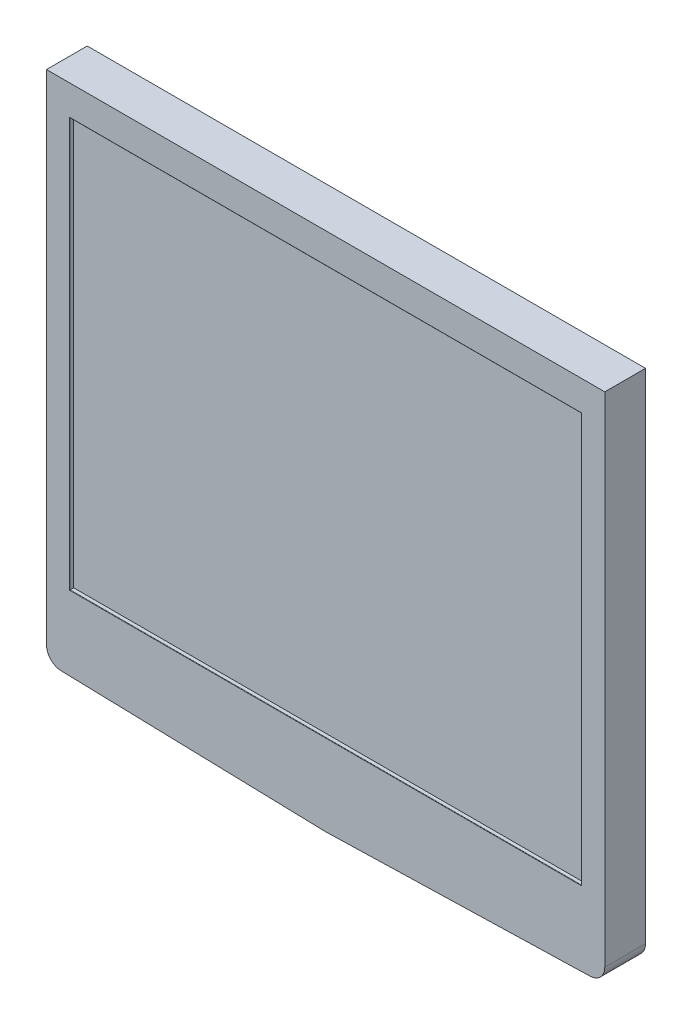
ISO-10303-21;
HEADER;
FILE_DESCRIPTION(('STEP AP214'),'2;1');
FILE_NAME('part.step','',(''),(''),'','','');
FILE_SCHEMA(('AUTOMOTIVE_DESIGN { 1 0 10303 214 1 1 1 1 }'));
ENDSEC;
DATA;
#1=APPLICATION_CONTEXT('core data for automotive mechanical design processes');
#2=APPLICATION_PROTOCOL_DEFINITION('international standard','automotive_design',2000,#1);
#3=PRODUCT_CONTEXT('',#1,'mechanical');
#4=PRODUCT('Part','Part','',(#3));
#5=PRODUCT_RELATED_PRODUCT_CATEGORY('part','',(#4));
#6=PRODUCT_DEFINITION_FORMATION('','',#4);
#7=PRODUCT_DEFINITION_CONTEXT('part definition',#1,'design');
#8=PRODUCT_DEFINITION('design','',#6,#7);
#9=PRODUCT_DEFINITION_SHAPE('','',#8);
#10=(LENGTH_UNIT() NAMED_UNIT(*) SI_UNIT(.MILLI.,.METRE.));
#11=(NAMED_UNIT(*) PLANE_ANGLE_UNIT() SI_UNIT($,.RADIAN.));
#12=(NAMED_UNIT(*) SI_UNIT($,.STERADIAN.) SOLID_ANGLE_UNIT());
#13=UNCERTAINTY_MEASURE_WITH_UNIT(LENGTH_MEASURE(1.E-05),#10,'distance_accuracy_value','');
#14=(GEOMETRIC_REPRESENTATION_CONTEXT(3) GLOBAL_UNCERTAINTY_ASSIGNED_CONTEXT((#13)) GLOBAL_UNIT_ASSIGNED_CONTEXT((#10,
#11,#12)) REPRESENTATION_CONTEXT('',''));
#15=CARTESIAN_POINT('',(0.,0.,0.));
#16=DIRECTION('',(0.,0.,1.));
#17=DIRECTION('',(1.,0.,0.));
#18=AXIS2_PLACEMENT_3D('',#15,#16,#17);
#19=CARTESIAN_POINT('',(342.,7.00730193549949,-25.));
#20=DIRECTION('',(0.,1.,0.));
#21=DIRECTION('',(0.,0.,1.));
#22=AXIS2_PLACEMENT_3D('',#19,#20,#21);
#23=PLANE('',#22);
#24=DIRECTION('',(-1.,0.,0.));
#25=VECTOR('',#24,1.);
#26=CARTESIAN_POINT('',(342.,7.00730193549949,0.));
#27=LINE('',#26,#25);
#28=CARTESIAN_POINT('',(342.,7.00730193549949,0.));
#29=VERTEX_POINT('',#28);
#30=CARTESIAN_POINT('',(273.063305355632,7.00730193549949,0.));
#31=VERTEX_POINT('',#30);
#32=EDGE_CURVE('E235',#29,#31,#27,.T.);
#33=ORIENTED_EDGE('',*,*,#32,.T.);
#34=DIRECTION('',(0.,0.,-1.));
#35=VECTOR('',#34,1.);
#36=CARTESIAN_POINT('',(273.063305355632,7.00730193549949,0.));
#37=LINE('',#36,#35);
#38=CARTESIAN_POINT('',(273.063305355632,7.00730193549949,-25.));
#39=VERTEX_POINT('',#38);
#40=EDGE_CURVE('E219',#31,#39,#37,.T.);
#41=ORIENTED_EDGE('',*,*,#40,.T.);
#42=DIRECTION('',(-1.,0.,0.));
#43=VECTOR('',#42,1.);
#44=CARTESIAN_POINT('',(342.,7.00730193549949,-25.));
#45=LINE('',#44,#43);
#46=CARTESIAN_POINT('',(307.,7.00730193549949,-25.));
#47=VERTEX_POINT('',#46);
#48=EDGE_CURVE('E368',#47,#39,#45,.T.);
#49=ORIENTED_EDGE('',*,*,#48,.F.);
#50=DIRECTION('',(0.813733471206736,0.,0.581238193719095));
#51=VECTOR('',#50,1.);
#52=CARTESIAN_POINT('',(307.,7.00730193549949,-25.));
#53=LINE('',#52,#51);
#54=EDGE_CURVE('E44',#47,#29,#53,.T.);
#55=ORIENTED_EDGE('',*,*,#54,.T.);
#56=EDGE_LOOP('',(#33,#41,#49,#55));
#57=FACE_BOUND('',#56,.T.);
#58=ADVANCED_FACE('F35',(#57),#23,.F.);
#59=CARTESIAN_POINT('',(10.,9.7333813639577,0.));
#60=DIRECTION('',(0.,0.,-1.));
#61=DIRECTION('',(-1.,0.,0.));
#62=AXIS2_PLACEMENT_3D('',#59,#60,#61);
#63=PLANE('',#62);
#64=DIRECTION('',(0.,1.,0.));
#65=VECTOR('',#64,1.);
#66=CARTESIAN_POINT('',(370.,9.73338136395777,0.));
#67=LINE('',#66,#65);
#68=CARTESIAN_POINT('',(370.,9.73338136395778,0.));
#69=VERTEX_POINT('',#68);
#70=CARTESIAN_POINT('',(370.,340.,0.));
#71=VERTEX_POINT('',#70);
#72=EDGE_CURVE('E270',#69,#71,#67,.T.);
#73=ORIENTED_EDGE('',*,*,#72,.F.);
#74=CARTESIAN_POINT('',(360.,9.7333813639577,0.));
#75=DIRECTION('',(0.,0.,1.));
#76=DIRECTION('',(1.,0.,0.));
#77=AXIS2_PLACEMENT_3D('',#74,#75,#76);
#78=CIRCLE('',#77,10.);
#79=CARTESIAN_POINT('',(360.270171613479,-0.262968334770833,0.));
#80=VERTEX_POINT('',#79);
#81=EDGE_CURVE('E283',#80,#69,#78,.T.);
#82=ORIENTED_EDGE('',*,*,#81,.F.);
#83=DIRECTION('',(0.999634969872854,0.0270171613479147,0.));
#84=VECTOR('',#83,1.);
#85=CARTESIAN_POINT('',(185.270171613479,-4.99269806450051,0.));
#86=LINE('',#85,#84);
#87=CARTESIAN_POINT('',(185.270171613479,-4.99269806450051,0.));
#88=VERTEX_POINT('',#87);
#89=EDGE_CURVE('E310',#88,#80,#86,.T.);
#90=ORIENTED_EDGE('',*,*,#89,.F.);
#91=CARTESIAN_POINT('',(185.,5.00365163422802,0.));
#92=DIRECTION('',(0.,0.,1.));
#93=DIRECTION('',(1.,0.,0.));
#94=AXIS2_PLACEMENT_3D('',#91,#92,#93);
#95=CIRCLE('',#94,10.);
#96=CARTESIAN_POINT('',(184.729828386521,-4.99269806450051,0.));
#97=VERTEX_POINT('',#96);
#98=EDGE_CURVE('E308',#97,#88,#95,.T.);
#99=ORIENTED_EDGE('',*,*,#98,.F.);
#100=DIRECTION('',(0.999634969872854,-0.0270171613479147,0.));
#101=VECTOR('',#100,1.);
#102=CARTESIAN_POINT('',(9.72982838652092,-0.262968334770833,0.));
#103=LINE('',#102,#101);
#104=CARTESIAN_POINT('',(9.72982838652092,-0.262968334770831,0.));
#105=VERTEX_POINT('',#104);
#106=EDGE_CURVE('E306',#105,#97,#103,.T.);
#107=ORIENTED_EDGE('',*,*,#106,.F.);
#108=CARTESIAN_POINT('',(10.,9.7333813639577,0.));
#109=DIRECTION('',(0.,0.,1.));
#110=DIRECTION('',(-1.,0.,0.));
#111=AXIS2_PLACEMENT_3D('',#108,#109,#110);
#112=CIRCLE('',#111,10.);
#113=CARTESIAN_POINT('',(0.,9.73338136395777,0.));
#114=VERTEX_POINT('',#113);
#115=EDGE_CURVE('E304',#114,#105,#112,.T.);
#116=ORIENTED_EDGE('',*,*,#115,.F.);
#117=DIRECTION('',(0.,-1.,0.));
#118=VECTOR('',#117,1.);
#119=CARTESIAN_POINT('',(0.,9.73338136395777,0.));
#120=LINE('',#119,#118);
#121=CARTESIAN_POINT('',(0.,340.,0.));
#122=VERTEX_POINT('',#121);
#123=EDGE_CURVE('E302',#122,#114,#120,.T.);
#124=ORIENTED_EDGE('',*,*,#123,.F.);
#125=DIRECTION('',(-1.,0.,0.));
#126=VECTOR('',#125,1.);
#127=CARTESIAN_POINT('',(0.,340.,0.));
#128=LINE('',#127,#126);
#129=EDGE_CURVE('E300',#71,#122,#128,.T.);
#130=ORIENTED_EDGE('',*,*,#129,.F.);
#131=EDGE_LOOP('',(#73,#82,#90,#99,#107,#116,#124,#130));
#132=FACE_BOUND('',#131,.T.);
#133=ORIENTED_EDGE('',*,*,#32,.F.);
#134=DIRECTION('',(0.,-1.,0.));
#135=VECTOR('',#134,1.);
#136=CARTESIAN_POINT('',(342.,303.,0.));
#137=LINE('',#136,#135);
#138=CARTESIAN_POINT('',(342.,303.,0.));
#139=VERTEX_POINT('',#138);
#140=EDGE_CURVE('E248',#139,#29,#137,.T.);
#141=ORIENTED_EDGE('',*,*,#140,.F.);
#142=DIRECTION('',(1.,0.,0.));
#143=VECTOR('',#142,1.);
#144=CARTESIAN_POINT('',(342.,303.,0.));
#145=LINE('',#144,#143);
#146=CARTESIAN_POINT('',(28.,303.,0.));
#147=VERTEX_POINT('',#146);
#148=EDGE_CURVE('E246',#147,#139,#145,.T.);
#149=ORIENTED_EDGE('',*,*,#148,.F.);
#150=DIRECTION('',(0.,1.,0.));
#151=VECTOR('',#150,1.);
#152=CARTESIAN_POINT('',(28.,303.,0.));
#153=LINE('',#152,#151);
#154=CARTESIAN_POINT('',(28.,7.00730193549949,0.));
#155=VERTEX_POINT('',#154);
#156=EDGE_CURVE('E243',#155,#147,#153,.T.);
#157=ORIENTED_EDGE('',*,*,#156,.F.);
#158=CARTESIAN_POINT('',(89.8266704035106,7.00730193549949,0.));
#159=VERTEX_POINT('',#158);
#160=EDGE_CURVE('E244',#159,#155,#27,.T.);
#161=ORIENTED_EDGE('',*,*,#160,.F.);
#162=DIRECTION('',(0.,1.,0.));
#163=VECTOR('',#162,1.);
#164=CARTESIAN_POINT('',(89.8266704035106,7.00730193549949,0.));
#165=LINE('',#164,#163);
#166=CARTESIAN_POINT('',(89.8266704035106,60.0073019354995,0.));
#167=VERTEX_POINT('',#166);
#168=EDGE_CURVE('E239',#159,#167,#165,.T.);
#169=ORIENTED_EDGE('',*,*,#168,.T.);
#170=DIRECTION('',(-1.,0.,0.));
#171=VECTOR('',#170,1.);
#172=CARTESIAN_POINT('',(89.8266704035106,60.0073019354995,0.));
#173=LINE('',#172,#171);
#174=CARTESIAN_POINT('',(66.8266704035106,60.0073019354995,0.));
#175=VERTEX_POINT('',#174);
#176=EDGE_CURVE('E819',#167,#175,#173,.T.);
#177=ORIENTED_EDGE('',*,*,#176,.T.);
#178=DIRECTION('',(0.,1.,0.));
#179=VECTOR('',#178,1.);
#180=CARTESIAN_POINT('',(66.8266704035106,60.0073019354995,0.));
#181=LINE('',#180,#179);
#182=CARTESIAN_POINT('',(66.8266704035106,108.0073019355,0.));
#183=VERTEX_POINT('',#182);
#184=EDGE_CURVE('E822',#175,#183,#181,.T.);
#185=ORIENTED_EDGE('',*,*,#184,.T.);
#186=DIRECTION('',(1.,0.,0.));
#187=VECTOR('',#186,1.);
#188=CARTESIAN_POINT('',(66.8266704035106,108.0073019355,0.));
#189=LINE('',#188,#187);
#190=CARTESIAN_POINT('',(296.063305355632,108.007301935499,0.));
#191=VERTEX_POINT('',#190);
#192=EDGE_CURVE('E825',#183,#191,#189,.T.);
#193=ORIENTED_EDGE('',*,*,#192,.T.);
#194=DIRECTION('',(0.,-1.,0.));
#195=VECTOR('',#194,1.);
#196=CARTESIAN_POINT('',(296.063305355632,108.007301935499,0.));
#197=LINE('',#196,#195);
#198=CARTESIAN_POINT('',(296.063305355632,60.0073019354995,0.));
#199=VERTEX_POINT('',#198);
#200=EDGE_CURVE('E828',#191,#199,#197,.T.);
#201=ORIENTED_EDGE('',*,*,#200,.T.);
#202=DIRECTION('',(-1.,0.,0.));
#203=VECTOR('',#202,1.);
#204=CARTESIAN_POINT('',(296.063305355632,60.0073019354995,0.));
#205=LINE('',#204,#203);
#206=CARTESIAN_POINT('',(273.063305355632,60.0073019354995,0.));
#207=VERTEX_POINT('',#206);
#208=EDGE_CURVE('E230',#199,#207,#205,.T.);
#209=ORIENTED_EDGE('',*,*,#208,.T.);
#210=DIRECTION('',(0.,-1.,0.));
#211=VECTOR('',#210,1.);
#212=CARTESIAN_POINT('',(273.063305355632,60.0073019354995,0.));
#213=LINE('',#212,#211);
#214=EDGE_CURVE('E222',#207,#31,#213,.T.);
#215=ORIENTED_EDGE('',*,*,#214,.T.);
#216=EDGE_LOOP('',(#133,#141,#149,#157,#161,#169,#177,#185,#193,#201,#209,#215));
#217=FACE_BOUND('',#216,.T.);
#218=ADVANCED_FACE('F234',(#132,#217),#63,.T.);
#219=CARTESIAN_POINT('',(370.,9.73338136395777,27.));
#220=DIRECTION('',(-1.,0.,0.));
#221=DIRECTION('',(0.,0.,1.));
#222=AXIS2_PLACEMENT_3D('',#219,#220,#221);
#223=PLANE('',#222);
#224=ORIENTED_EDGE('',*,*,#72,.T.);
#225=DIRECTION('',(0.,0.,-1.));
#226=VECTOR('',#225,1.);
#227=CARTESIAN_POINT('',(370.,340.,27.));
#228=LINE('',#227,#226);
#229=CARTESIAN_POINT('',(370.,340.,27.));
#230=VERTEX_POINT('',#229);
#231=EDGE_CURVE('E333',#230,#71,#228,.T.);
#232=ORIENTED_EDGE('',*,*,#231,.F.);
#233=DIRECTION('',(0.,1.,0.));
#234=VECTOR('',#233,1.);
#235=CARTESIAN_POINT('',(370.,9.73338136395777,27.));
#236=LINE('',#235,#234);
#237=CARTESIAN_POINT('',(370.,9.73338136395778,27.));
#238=VERTEX_POINT('',#237);
#239=EDGE_CURVE('E279',#238,#230,#236,.T.);
#240=ORIENTED_EDGE('',*,*,#239,.F.);
#241=DIRECTION('',(0.,0.,-1.));
#242=VECTOR('',#241,1.);
#243=CARTESIAN_POINT('',(370.,9.73338136395778,27.));
#244=LINE('',#243,#242);
#245=EDGE_CURVE('E297',#238,#69,#244,.T.);
#246=ORIENTED_EDGE('',*,*,#245,.T.);
#247=EDGE_LOOP('',(#224,#232,#240,#246));
#248=FACE_BOUND('',#247,.T.);
#249=ADVANCED_FACE('F421',(#248),#223,.F.);
#250=CARTESIAN_POINT('',(0.,340.,27.));
#251=DIRECTION('',(0.,-1.,0.));
#252=DIRECTION('',(0.,0.,-1.));
#253=AXIS2_PLACEMENT_3D('',#250,#251,#252);
#254=PLANE('',#253);
#255=ORIENTED_EDGE('',*,*,#129,.T.);
#256=DIRECTION('',(0.,0.,-1.));
#257=VECTOR('',#256,1.);
#258=CARTESIAN_POINT('',(0.,340.,27.));
#259=LINE('',#258,#257);
#260=CARTESIAN_POINT('',(0.,340.,27.));
#261=VERTEX_POINT('',#260);
#262=EDGE_CURVE('E330',#261,#122,#259,.T.);
#263=ORIENTED_EDGE('',*,*,#262,.F.);
#264=DIRECTION('',(-1.,0.,0.));
#265=VECTOR('',#264,1.);
#266=CARTESIAN_POINT('',(0.,340.,27.));
#267=LINE('',#266,#265);
#268=EDGE_CURVE('E282',#230,#261,#267,.T.);
#269=ORIENTED_EDGE('',*,*,#268,.F.);
#270=ORIENTED_EDGE('',*,*,#231,.T.);
#271=EDGE_LOOP('',(#255,#263,#269,#270));
#272=FACE_BOUND('',#271,.T.);
#273=ADVANCED_FACE('F516',(#272),#254,.F.);
#274=CARTESIAN_POINT('',(0.,9.73338136395777,27.));
#275=DIRECTION('',(1.,0.,0.));
#276=DIRECTION('',(0.,0.,-1.));
#277=AXIS2_PLACEMENT_3D('',#274,#275,#276);
#278=PLANE('',#277);
#279=ORIENTED_EDGE('',*,*,#123,.T.);
#280=DIRECTION('',(0.,0.,-1.));
#281=VECTOR('',#280,1.);
#282=CARTESIAN_POINT('',(0.,9.73338136395777,27.));
#283=LINE('',#282,#281);
#284=CARTESIAN_POINT('',(0.,9.73338136395777,27.));
#285=VERTEX_POINT('',#284);
#286=EDGE_CURVE('E327',#285,#114,#283,.T.);
#287=ORIENTED_EDGE('',*,*,#286,.F.);
#288=DIRECTION('',(0.,-1.,0.));
#289=VECTOR('',#288,1.);
#290=CARTESIAN_POINT('',(0.,9.73338136395777,27.));
#291=LINE('',#290,#289);
#292=EDGE_CURVE('E285',#261,#285,#291,.T.);
#293=ORIENTED_EDGE('',*,*,#292,.F.);
#294=ORIENTED_EDGE('',*,*,#262,.T.);
#295=EDGE_LOOP('',(#279,#287,#293,#294));
#296=FACE_BOUND('',#295,.T.);
#297=ADVANCED_FACE('F512',(#296),#278,.F.);
#298=CARTESIAN_POINT('',(10.,9.7333813639577,27.));
#299=DIRECTION('',(0.,0.,-1.));
#300=DIRECTION('',(-1.,0.,0.));
#301=AXIS2_PLACEMENT_3D('',#298,#299,#300);
#302=CYLINDRICAL_SURFACE('',#301,10.);
#303=ORIENTED_EDGE('',*,*,#115,.T.);
#304=DIRECTION('',(0.,0.,-1.));
#305=VECTOR('',#304,1.);
#306=CARTESIAN_POINT('',(9.72982838652092,-0.262968334770831,27.));
#307=LINE('',#306,#305);
#308=CARTESIAN_POINT('',(9.72982838652092,-0.262968334770831,27.));
#309=VERTEX_POINT('',#308);
#310=EDGE_CURVE('E324',#309,#105,#307,.T.);
#311=ORIENTED_EDGE('',*,*,#310,.F.);
#312=CARTESIAN_POINT('',(10.,9.7333813639577,27.));
#313=DIRECTION('',(0.,0.,1.));
#314=DIRECTION('',(-1.,0.,0.));
#315=AXIS2_PLACEMENT_3D('',#312,#313,#314);
#316=CIRCLE('',#315,10.);
#317=EDGE_CURVE('E287',#285,#309,#316,.T.);
#318=ORIENTED_EDGE('',*,*,#317,.F.);
#319=ORIENTED_EDGE('',*,*,#286,.T.);
#320=EDGE_LOOP('',(#303,#311,#318,#319));
#321=FACE_BOUND('',#320,.T.);
#322=ADVANCED_FACE('F508',(#321),#302,.T.);
#323=CARTESIAN_POINT('',(9.72982838652092,-0.262968334770833,27.));
#324=DIRECTION('',(0.0270171613479147,0.999634969872854,0.));
#325=DIRECTION('',(-0.999634969872854,0.0270171613479147,0.));
#326=AXIS2_PLACEMENT_3D('',#323,#324,#325);
#327=PLANE('',#326);
#328=ORIENTED_EDGE('',*,*,#106,.T.);
#329=DIRECTION('',(0.,0.,-1.));
#330=VECTOR('',#329,1.);
#331=CARTESIAN_POINT('',(184.729828386521,-4.99269806450051,27.));
#332=LINE('',#331,#330);
#333=CARTESIAN_POINT('',(184.729828386521,-4.99269806450051,27.));
#334=VERTEX_POINT('',#333);
#335=EDGE_CURVE('E321',#334,#97,#332,.T.);
#336=ORIENTED_EDGE('',*,*,#335,.F.);
#337=DIRECTION('',(0.999634969872854,-0.0270171613479147,0.));
#338=VECTOR('',#337,1.);
#339=CARTESIAN_POINT('',(9.72982838652092,-0.262968334770833,27.));
#340=LINE('',#339,#338);
#341=EDGE_CURVE('E289',#309,#334,#340,.T.);
#342=ORIENTED_EDGE('',*,*,#341,.F.);
#343=ORIENTED_EDGE('',*,*,#310,.T.);
#344=EDGE_LOOP('',(#328,#336,#342,#343));
#345=FACE_BOUND('',#344,.T.);
#346=ADVANCED_FACE('F504',(#345),#327,.F.);
#347=CARTESIAN_POINT('',(185.,5.00365163422802,27.));
#348=DIRECTION('',(0.,0.,-1.));
#349=DIRECTION('',(-1.,0.,0.));
#350=AXIS2_PLACEMENT_3D('',#347,#348,#349);
#351=CYLINDRICAL_SURFACE('',#350,10.);
#352=ORIENTED_EDGE('',*,*,#98,.T.);
#353=DIRECTION('',(0.,0.,-1.));
#354=VECTOR('',#353,1.);
#355=CARTESIAN_POINT('',(185.270171613479,-4.99269806450051,27.));
#356=LINE('',#355,#354);
#357=CARTESIAN_POINT('',(185.270171613479,-4.99269806450051,27.));
#358=VERTEX_POINT('',#357);
#359=EDGE_CURVE('E318',#358,#88,#356,.T.);
#360=ORIENTED_EDGE('',*,*,#359,.F.);
#361=CARTESIAN_POINT('',(185.,5.00365163422802,27.));
#362=DIRECTION('',(0.,0.,1.));
#363=DIRECTION('',(1.,0.,0.));
#364=AXIS2_PLACEMENT_3D('',#361,#362,#363);
#365=CIRCLE('',#364,10.);
#366=EDGE_CURVE('E291',#334,#358,#365,.T.);
#367=ORIENTED_EDGE('',*,*,#366,.F.);
#368=ORIENTED_EDGE('',*,*,#335,.T.);
#369=EDGE_LOOP('',(#352,#360,#367,#368));
#370=FACE_BOUND('',#369,.T.);
#371=ADVANCED_FACE('F500',(#370),#351,.T.);
#372=CARTESIAN_POINT('',(185.270171613479,-4.99269806450051,27.));
#373=DIRECTION('',(-0.0270171613479147,0.999634969872854,0.));
#374=DIRECTION('',(-0.999634969872854,-0.0270171613479147,0.));
#375=AXIS2_PLACEMENT_3D('',#372,#373,#374);
#376=PLANE('',#375);
#377=ORIENTED_EDGE('',*,*,#89,.T.);
#378=DIRECTION('',(0.,0.,-1.));
#379=VECTOR('',#378,1.);
#380=CARTESIAN_POINT('',(360.270171613479,-0.262968334770833,27.));
#381=LINE('',#380,#379);
#382=CARTESIAN_POINT('',(360.270171613479,-0.262968334770833,27.));
#383=VERTEX_POINT('',#382);
#384=EDGE_CURVE('E315',#383,#80,#381,.T.);
#385=ORIENTED_EDGE('',*,*,#384,.F.);
#386=DIRECTION('',(0.999634969872854,0.0270171613479147,0.));
#387=VECTOR('',#386,1.);
#388=CARTESIAN_POINT('',(185.270171613479,-4.99269806450051,27.));
#389=LINE('',#388,#387);
#390=EDGE_CURVE('E293',#358,#383,#389,.T.);
#391=ORIENTED_EDGE('',*,*,#390,.F.);
#392=ORIENTED_EDGE('',*,*,#359,.T.);
#393=EDGE_LOOP('',(#377,#385,#391,#392));
#394=FACE_BOUND('',#393,.T.);
#395=ADVANCED_FACE('F496',(#394),#376,.F.);
#396=CARTESIAN_POINT('',(360.,9.7333813639577,27.));
#397=DIRECTION('',(0.,0.,-1.));
#398=DIRECTION('',(-1.,0.,0.));
#399=AXIS2_PLACEMENT_3D('',#396,#397,#398);
#400=CYLINDRICAL_SURFACE('',#399,10.);
#401=ORIENTED_EDGE('',*,*,#81,.T.);
#402=ORIENTED_EDGE('',*,*,#245,.F.);
#403=CARTESIAN_POINT('',(360.,9.7333813639577,27.));
#404=DIRECTION('',(0.,0.,1.));
#405=DIRECTION('',(1.,0.,0.));
#406=AXIS2_PLACEMENT_3D('',#403,#404,#405);
#407=CIRCLE('',#406,10.);
#408=EDGE_CURVE('E295',#383,#238,#407,.T.);
#409=ORIENTED_EDGE('',*,*,#408,.F.);
#410=ORIENTED_EDGE('',*,*,#384,.T.);
#411=EDGE_LOOP('',(#401,#402,#409,#410));
#412=FACE_BOUND('',#411,.T.);
#413=ADVANCED_FACE('F489',(#412),#400,.T.);
#414=CARTESIAN_POINT('',(10.,9.7333813639577,27.));
#415=DIRECTION('',(0.,0.,-1.));
#416=DIRECTION('',(-1.,0.,0.));
#417=AXIS2_PLACEMENT_3D('',#414,#415,#416);
#418=PLANE('',#417);
#419=DIRECTION('',(0.,1.,0.));
#420=VECTOR('',#419,1.);
#421=CARTESIAN_POINT('',(354.5,320.,27.));
#422=LINE('',#421,#420);
#423=CARTESIAN_POINT('',(354.5,48.746,27.));
#424=VERTEX_POINT('',#423);
#425=CARTESIAN_POINT('',(354.5,320.254,27.));
#426=VERTEX_POINT('',#425);
#427=EDGE_CURVE('E259',#424,#426,#422,.T.);
#428=ORIENTED_EDGE('',*,*,#427,.F.);
#429=DIRECTION('',(1.,0.,0.));
#430=VECTOR('',#429,1.);
#431=CARTESIAN_POINT('',(10.,48.746,27.));
#432=LINE('',#431,#430);
#433=CARTESIAN_POINT('',(15.2460000000001,48.746,27.));
#434=VERTEX_POINT('',#433);
#435=EDGE_CURVE('E355',#424,#434,#432,.F.);
#436=ORIENTED_EDGE('',*,*,#435,.T.);
#437=DIRECTION('',(0.,-1.,0.));
#438=VECTOR('',#437,1.);
#439=CARTESIAN_POINT('',(15.2460000000001,9.7333813639577,27.));
#440=LINE('',#439,#438);
#441=CARTESIAN_POINT('',(15.246,320.254,27.));
#442=VERTEX_POINT('',#441);
#443=EDGE_CURVE('E353',#434,#442,#440,.F.);
#444=ORIENTED_EDGE('',*,*,#443,.T.);
#445=DIRECTION('',(-1.,0.,0.));
#446=VECTOR('',#445,1.);
#447=CARTESIAN_POINT('',(10.,320.254,27.));
#448=LINE('',#447,#446);
#449=EDGE_CURVE('E350',#442,#426,#448,.F.);
#450=ORIENTED_EDGE('',*,*,#449,.T.);
#451=EDGE_LOOP('',(#428,#436,#444,#450));
#452=FACE_BOUND('',#451,.T.);
#453=ORIENTED_EDGE('',*,*,#239,.T.);
#454=ORIENTED_EDGE('',*,*,#268,.T.);
#455=ORIENTED_EDGE('',*,*,#292,.T.);
#456=ORIENTED_EDGE('',*,*,#317,.T.);
#457=ORIENTED_EDGE('',*,*,#341,.T.);
#458=ORIENTED_EDGE('',*,*,#366,.T.);
#459=ORIENTED_EDGE('',*,*,#390,.T.);
#460=ORIENTED_EDGE('',*,*,#408,.T.);
#461=EDGE_LOOP('',(#453,#454,#455,#456,#457,#458,#459,#460));
#462=FACE_BOUND('',#461,.T.);
#463=ADVANCED_FACE('F477',(#452,#462),#418,.F.);
#464=CARTESIAN_POINT('',(15.5,320.,24.46));
#465=DIRECTION('',(-1.,0.,0.));
#466=DIRECTION('',(0.,-1.,0.));
#467=AXIS2_PLACEMENT_3D('',#464,#465,#466);
#468=PLANE('',#467);
#469=DIRECTION('',(0.,0.,1.));
#470=VECTOR('',#469,1.);
#471=CARTESIAN_POINT('',(15.5,320.,24.46));
#472=LINE('',#471,#470);
#473=CARTESIAN_POINT('',(15.5,320.,24.46));
#474=VERTEX_POINT('',#473);
#475=CARTESIAN_POINT('',(15.5,320.,26.746));
#476=VERTEX_POINT('',#475);
#477=EDGE_CURVE('E267',#474,#476,#472,.T.);
#478=ORIENTED_EDGE('',*,*,#477,.T.);
#479=DIRECTION('',(0.,-1.,0.));
#480=VECTOR('',#479,1.);
#481=CARTESIAN_POINT('',(15.5,320.,26.746));
#482=LINE('',#481,#480);
#483=CARTESIAN_POINT('',(15.5000000000001,49.,26.746));
#484=VERTEX_POINT('',#483);
#485=EDGE_CURVE('E357',#476,#484,#482,.T.);
#486=ORIENTED_EDGE('',*,*,#485,.T.);
#487=DIRECTION('',(0.,0.,1.));
#488=VECTOR('',#487,1.);
#489=CARTESIAN_POINT('',(15.5000000000001,49.,24.46));
#490=LINE('',#489,#488);
#491=CARTESIAN_POINT('',(15.5000000000001,49.,24.46));
#492=VERTEX_POINT('',#491);
#493=EDGE_CURVE('E264',#492,#484,#490,.T.);
#494=ORIENTED_EDGE('',*,*,#493,.F.);
#495=DIRECTION('',(0.,-1.,0.));
#496=VECTOR('',#495,1.);
#497=CARTESIAN_POINT('',(15.5,320.,24.46));
#498=LINE('',#497,#496);
#499=EDGE_CURVE('E255',#474,#492,#498,.T.);
#500=ORIENTED_EDGE('',*,*,#499,.F.);
#501=EDGE_LOOP('',(#478,#486,#494,#500));
#502=FACE_BOUND('',#501,.T.);
#503=ADVANCED_FACE('F481',(#502),#468,.F.);
#504=CARTESIAN_POINT('',(15.5,320.,24.46));
#505=DIRECTION('',(0.,1.,0.));
#506=DIRECTION('',(0.,0.,1.));
#507=AXIS2_PLACEMENT_3D('',#504,#505,#506);
#508=PLANE('',#507);
#509=DIRECTION('',(-1.,0.,0.));
#510=VECTOR('',#509,1.);
#511=CARTESIAN_POINT('',(15.5,320.,24.46));
#512=LINE('',#511,#510);
#513=CARTESIAN_POINT('',(354.246,320.,24.46));
#514=VERTEX_POINT('',#513);
#515=EDGE_CURVE('E262',#514,#474,#512,.T.);
#516=ORIENTED_EDGE('',*,*,#515,.F.);
#517=CARTESIAN_POINT('',(354.246,320.,24.714));
#518=DIRECTION('',(0.,1.,0.));
#519=DIRECTION('',(0.,0.,1.));
#520=AXIS2_PLACEMENT_3D('',#517,#518,#519);
#521=CIRCLE('',#520,0.254);
#522=CARTESIAN_POINT('',(354.5,320.,24.714));
#523=VERTEX_POINT('',#522);
#524=EDGE_CURVE('E341',#514,#523,#521,.F.);
#525=ORIENTED_EDGE('',*,*,#524,.T.);
#526=DIRECTION('',(0.,0.,1.));
#527=VECTOR('',#526,1.);
#528=CARTESIAN_POINT('',(354.5,320.,24.46));
#529=LINE('',#528,#527);
#530=CARTESIAN_POINT('',(354.5,320.,26.746));
#531=VERTEX_POINT('',#530);
#532=EDGE_CURVE('E271',#523,#531,#529,.T.);
#533=ORIENTED_EDGE('',*,*,#532,.T.);
#534=DIRECTION('',(-1.,0.,0.));
#535=VECTOR('',#534,1.);
#536=CARTESIAN_POINT('',(15.5,320.,26.746));
#537=LINE('',#536,#535);
#538=EDGE_CURVE('E339',#531,#476,#537,.T.);
#539=ORIENTED_EDGE('',*,*,#538,.T.);
#540=ORIENTED_EDGE('',*,*,#477,.F.);
#541=EDGE_LOOP('',(#516,#525,#533,#539,#540));
#542=FACE_BOUND('',#541,.T.);
#543=ADVANCED_FACE('F462',(#542),#508,.F.);
#544=CARTESIAN_POINT('',(354.5,320.,24.46));
#545=DIRECTION('',(1.,0.,0.));
#546=DIRECTION('',(0.,1.,0.));
#547=AXIS2_PLACEMENT_3D('',#544,#545,#546);
#548=PLANE('',#547);
#549=ORIENTED_EDGE('',*,*,#532,.F.);
#550=DIRECTION('',(0.,1.,0.));
#551=VECTOR('',#550,1.);
#552=CARTESIAN_POINT('',(354.5,320.,24.714));
#553=LINE('',#552,#551);
#554=CARTESIAN_POINT('',(354.5,49.,24.714));
#555=VERTEX_POINT('',#554);
#556=EDGE_CURVE('E343',#523,#555,#553,.F.);
#557=ORIENTED_EDGE('',*,*,#556,.T.);
#558=DIRECTION('',(0.,0.,1.));
#559=VECTOR('',#558,1.);
#560=CARTESIAN_POINT('',(354.5,49.,24.46));
#561=LINE('',#560,#559);
#562=CARTESIAN_POINT('',(354.5,49.,26.746));
#563=VERTEX_POINT('',#562);
#564=EDGE_CURVE('E274',#555,#563,#561,.T.);
#565=ORIENTED_EDGE('',*,*,#564,.T.);
#566=CARTESIAN_POINT('',(354.5,48.746,26.746));
#567=DIRECTION('',(1.,0.,0.));
#568=DIRECTION('',(0.,1.,0.));
#569=AXIS2_PLACEMENT_3D('',#566,#567,#568);
#570=CIRCLE('',#569,0.254);
#571=EDGE_CURVE('E359',#563,#424,#570,.T.);
#572=ORIENTED_EDGE('',*,*,#571,.T.);
#573=ORIENTED_EDGE('',*,*,#427,.T.);
#574=CARTESIAN_POINT('',(354.5,320.254,26.746));
#575=DIRECTION('',(1.,0.,0.));
#576=DIRECTION('',(0.,1.,0.));
#577=AXIS2_PLACEMENT_3D('',#574,#575,#576);
#578=CIRCLE('',#577,0.254);
#579=EDGE_CURVE('E362',#426,#531,#578,.T.);
#580=ORIENTED_EDGE('',*,*,#579,.T.);
#581=EDGE_LOOP('',(#549,#557,#565,#572,#573,#580));
#582=FACE_BOUND('',#581,.T.);
#583=ADVANCED_FACE('F458',(#582),#548,.F.);
#584=CARTESIAN_POINT('',(15.5000000000001,49.,24.46));
#585=DIRECTION('',(0.,-1.,0.));
#586=DIRECTION('',(0.,0.,-1.));
#587=AXIS2_PLACEMENT_3D('',#584,#585,#586);
#588=PLANE('',#587);
#589=ORIENTED_EDGE('',*,*,#564,.F.);
#590=CARTESIAN_POINT('',(354.246,49.,24.714));
#591=DIRECTION('',(0.,-1.,0.));
#592=DIRECTION('',(0.,0.,-1.));
#593=AXIS2_PLACEMENT_3D('',#590,#591,#592);
#594=CIRCLE('',#593,0.254);
#595=CARTESIAN_POINT('',(354.246,49.,24.46));
#596=VERTEX_POINT('',#595);
#597=EDGE_CURVE('E348',#555,#596,#594,.F.);
#598=ORIENTED_EDGE('',*,*,#597,.T.);
#599=DIRECTION('',(1.,0.,0.));
#600=VECTOR('',#599,1.);
#601=CARTESIAN_POINT('',(15.5000000000001,49.,24.46));
#602=LINE('',#601,#600);
#603=EDGE_CURVE('E258',#492,#596,#602,.T.);
#604=ORIENTED_EDGE('',*,*,#603,.F.);
#605=ORIENTED_EDGE('',*,*,#493,.T.);
#606=DIRECTION('',(1.,0.,0.));
#607=VECTOR('',#606,1.);
#608=CARTESIAN_POINT('',(15.5000000000001,49.,26.746));
#609=LINE('',#608,#607);
#610=EDGE_CURVE('E345',#484,#563,#609,.T.);
#611=ORIENTED_EDGE('',*,*,#610,.T.);
#612=EDGE_LOOP('',(#589,#598,#604,#605,#611));
#613=FACE_BOUND('',#612,.T.);
#614=ADVANCED_FACE('F471',(#613),#588,.F.);
#615=CARTESIAN_POINT('',(15.5000000000001,49.,24.46));
#616=DIRECTION('',(0.,0.,1.));
#617=DIRECTION('',(1.,0.,0.));
#618=AXIS2_PLACEMENT_3D('',#615,#616,#617);
#619=PLANE('',#618);
#620=ORIENTED_EDGE('',*,*,#603,.T.);
#621=DIRECTION('',(0.,1.,0.));
#622=VECTOR('',#621,1.);
#623=CARTESIAN_POINT('',(354.246,49.0000000000001,24.46));
#624=LINE('',#623,#622);
#625=EDGE_CURVE('E336',#596,#514,#624,.T.);
#626=ORIENTED_EDGE('',*,*,#625,.T.);
#627=ORIENTED_EDGE('',*,*,#515,.T.);
#628=ORIENTED_EDGE('',*,*,#499,.T.);
#629=EDGE_LOOP('',(#620,#626,#627,#628));
#630=FACE_BOUND('',#629,.T.);
#631=ADVANCED_FACE('F450',(#630),#619,.T.);
#632=CARTESIAN_POINT('',(354.246,49.0000000000001,24.714));
#633=DIRECTION('',(0.,1.,0.));
#634=DIRECTION('',(-1.,0.,0.));
#635=AXIS2_PLACEMENT_3D('',#632,#633,#634);
#636=CYLINDRICAL_SURFACE('',#635,0.254);
#637=ORIENTED_EDGE('',*,*,#597,.F.);
#638=ORIENTED_EDGE('',*,*,#556,.F.);
#639=ORIENTED_EDGE('',*,*,#524,.F.);
#640=ORIENTED_EDGE('',*,*,#625,.F.);
#641=EDGE_LOOP('',(#637,#638,#639,#640));
#642=FACE_BOUND('',#641,.T.);
#643=ADVANCED_FACE('F443',(#642),#636,.F.);
#644=CARTESIAN_POINT('',(15.5,320.254,26.746));
#645=DIRECTION('',(-1.,0.,0.));
#646=DIRECTION('',(0.,0.,1.));
#647=AXIS2_PLACEMENT_3D('',#644,#645,#646);
#648=CYLINDRICAL_SURFACE('',#647,0.254);
#649=ORIENTED_EDGE('',*,*,#579,.F.);
#650=ORIENTED_EDGE('',*,*,#449,.F.);
#651=CARTESIAN_POINT('',(15.246,320.254,26.746));
#652=DIRECTION('',(-0.707106781186547,-0.707106781186548,0.));
#653=DIRECTION('',(0.707106781186548,-0.707106781186547,0.));
#654=AXIS2_PLACEMENT_3D('',#651,#652,#653);
#655=ELLIPSE('',#654,0.359210244842766,0.254);
#656=EDGE_CURVE('E266',#476,#442,#655,.T.);
#657=ORIENTED_EDGE('',*,*,#656,.F.);
#658=ORIENTED_EDGE('',*,*,#538,.F.);
#659=EDGE_LOOP('',(#649,#650,#657,#658));
#660=FACE_BOUND('',#659,.T.);
#661=ADVANCED_FACE('F439',(#660),#648,.T.);
#662=CARTESIAN_POINT('',(15.246,320.,26.746));
#663=DIRECTION('',(0.,-1.,0.));
#664=DIRECTION('',(1.,0.,0.));
#665=AXIS2_PLACEMENT_3D('',#662,#663,#664);
#666=CYLINDRICAL_SURFACE('',#665,0.254);
#667=ORIENTED_EDGE('',*,*,#656,.T.);
#668=ORIENTED_EDGE('',*,*,#443,.F.);
#669=CARTESIAN_POINT('',(15.2460000000001,48.746,26.746));
#670=DIRECTION('',(0.707106781186548,-0.707106781186547,0.));
#671=DIRECTION('',(0.707106781186547,0.707106781186548,0.));
#672=AXIS2_PLACEMENT_3D('',#669,#670,#671);
#673=ELLIPSE('',#672,0.359210244842766,0.254);
#674=EDGE_CURVE('E365',#484,#434,#673,.T.);
#675=ORIENTED_EDGE('',*,*,#674,.F.);
#676=ORIENTED_EDGE('',*,*,#485,.F.);
#677=EDGE_LOOP('',(#667,#668,#675,#676));
#678=FACE_BOUND('',#677,.T.);
#679=ADVANCED_FACE('F433',(#678),#666,.T.);
#680=CARTESIAN_POINT('',(15.5000000000001,48.746,26.746));
#681=DIRECTION('',(1.,0.,0.));
#682=DIRECTION('',(0.,0.,-1.));
#683=AXIS2_PLACEMENT_3D('',#680,#681,#682);
#684=CYLINDRICAL_SURFACE('',#683,0.254);
#685=ORIENTED_EDGE('',*,*,#674,.T.);
#686=ORIENTED_EDGE('',*,*,#435,.F.);
#687=ORIENTED_EDGE('',*,*,#571,.F.);
#688=ORIENTED_EDGE('',*,*,#610,.F.);
#689=EDGE_LOOP('',(#685,#686,#687,#688));
#690=FACE_BOUND('',#689,.T.);
#691=ADVANCED_FACE('F427',(#690),#684,.T.);
#692=CARTESIAN_POINT('',(89.8266704035106,7.00730193549949,-25.));
#693=VERTEX_POINT('',#692);
#694=CARTESIAN_POINT('',(63.0000000000003,7.00730193549949,-25.0000000000001));
#695=VERTEX_POINT('',#694);
#696=EDGE_CURVE('E254',#693,#695,#45,.T.);
#697=ORIENTED_EDGE('',*,*,#696,.F.);
#698=DIRECTION('',(0.,0.,-1.));
#699=VECTOR('',#698,1.);
#700=CARTESIAN_POINT('',(89.8266704035106,7.00730193549949,0.));
#701=LINE('',#700,#699);
#702=EDGE_CURVE('E52',#159,#693,#701,.T.);
#703=ORIENTED_EDGE('',*,*,#702,.F.);
#704=ORIENTED_EDGE('',*,*,#160,.T.);
#705=DIRECTION('',(0.813733471206736,0.,-0.581238193719095));
#706=VECTOR('',#705,1.);
#707=CARTESIAN_POINT('',(63.0000000000001,7.00730193549949,-25.));
#708=LINE('',#707,#706);
#709=EDGE_CURVE('E11',#155,#695,#708,.T.);
#710=ORIENTED_EDGE('',*,*,#709,.T.);
#711=EDGE_LOOP('',(#697,#703,#704,#710));
#712=FACE_BOUND('',#711,.T.);
#713=ADVANCED_FACE('F401',(#712),#23,.F.);
#714=CARTESIAN_POINT('',(0.,0.,-25.));
#715=DIRECTION('',(0.,0.,-1.));
#716=DIRECTION('',(-1.,0.,0.));
#717=AXIS2_PLACEMENT_3D('',#714,#715,#716);
#718=PLANE('',#717);
#719=CARTESIAN_POINT('',(132.,193.,-25.));
#720=DIRECTION('',(0.,0.,-1.));
#721=DIRECTION('',(-1.,0.,0.));
#722=AXIS2_PLACEMENT_3D('',#719,#720,#721);
#723=CIRCLE('',#722,2.5);
#724=CARTESIAN_POINT('',(129.5,193.,-25.));
#725=VERTEX_POINT('',#724);
#726=EDGE_CURVE('E801',#725,#725,#723,.T.);
#727=ORIENTED_EDGE('',*,*,#726,.F.);
#728=EDGE_LOOP('',(#727));
#729=FACE_BOUND('',#728,.T.);
#730=CARTESIAN_POINT('',(238.,193.,-25.));
#731=DIRECTION('',(0.,0.,-1.));
#732=DIRECTION('',(-1.,0.,0.));
#733=AXIS2_PLACEMENT_3D('',#730,#731,#732);
#734=CIRCLE('',#733,2.50000000000002);
#735=CARTESIAN_POINT('',(235.5,193.,-25.));
#736=VERTEX_POINT('',#735);
#737=EDGE_CURVE('E800',#736,#736,#734,.T.);
#738=ORIENTED_EDGE('',*,*,#737,.F.);
#739=EDGE_LOOP('',(#738));
#740=FACE_BOUND('',#739,.T.);
#741=CARTESIAN_POINT('',(188.,255.8,-25.));
#742=DIRECTION('',(0.,0.,-1.));
#743=DIRECTION('',(-1.,0.,0.));
#744=AXIS2_PLACEMENT_3D('',#741,#742,#743);
#745=CIRCLE('',#744,2.5);
#746=CARTESIAN_POINT('',(185.5,255.8,-25.));
#747=VERTEX_POINT('',#746);
#748=EDGE_CURVE('E810',#747,#747,#745,.T.);
#749=ORIENTED_EDGE('',*,*,#748,.F.);
#750=EDGE_LOOP('',(#749));
#751=FACE_BOUND('',#750,.T.);
#752=DIRECTION('',(0.,-1.,0.));
#753=VECTOR('',#752,1.);
#754=CARTESIAN_POINT('',(273.063305355632,60.0073019354995,-25.));
#755=LINE('',#754,#753);
#756=CARTESIAN_POINT('',(273.063305355632,60.0073019354995,-25.));
#757=VERTEX_POINT('',#756);
#758=EDGE_CURVE('E225',#757,#39,#755,.T.);
#759=ORIENTED_EDGE('',*,*,#758,.F.);
#760=DIRECTION('',(-1.,0.,0.));
#761=VECTOR('',#760,1.);
#762=CARTESIAN_POINT('',(296.063305355632,60.0073019354995,-25.));
#763=LINE('',#762,#761);
#764=CARTESIAN_POINT('',(296.063305355632,60.0073019354995,-25.));
#765=VERTEX_POINT('',#764);
#766=EDGE_CURVE('E240',#765,#757,#763,.T.);
#767=ORIENTED_EDGE('',*,*,#766,.F.);
#768=DIRECTION('',(0.,-1.,0.));
#769=VECTOR('',#768,1.);
#770=CARTESIAN_POINT('',(296.063305355632,108.007301935499,-25.));
#771=LINE('',#770,#769);
#772=CARTESIAN_POINT('',(296.063305355632,108.007301935499,-25.));
#773=VERTEX_POINT('',#772);
#774=EDGE_CURVE('E841',#773,#765,#771,.T.);
#775=ORIENTED_EDGE('',*,*,#774,.F.);
#776=DIRECTION('',(1.,0.,0.));
#777=VECTOR('',#776,1.);
#778=CARTESIAN_POINT('',(66.8266704035106,108.0073019355,-25.));
#779=LINE('',#778,#777);
#780=CARTESIAN_POINT('',(66.8266704035106,108.0073019355,-25.));
#781=VERTEX_POINT('',#780);
#782=EDGE_CURVE('E839',#781,#773,#779,.T.);
#783=ORIENTED_EDGE('',*,*,#782,.F.);
#784=DIRECTION('',(0.,1.,0.));
#785=VECTOR('',#784,1.);
#786=CARTESIAN_POINT('',(66.8266704035106,60.0073019354995,-25.));
#787=LINE('',#786,#785);
#788=CARTESIAN_POINT('',(66.8266704035106,60.0073019354995,-25.));
#789=VERTEX_POINT('',#788);
#790=EDGE_CURVE('E836',#789,#781,#787,.T.);
#791=ORIENTED_EDGE('',*,*,#790,.F.);
#792=DIRECTION('',(-1.,0.,0.));
#793=VECTOR('',#792,1.);
#794=CARTESIAN_POINT('',(89.8266704035106,60.0073019354995,-25.));
#795=LINE('',#794,#793);
#796=CARTESIAN_POINT('',(89.8266704035106,60.0073019354995,-25.));
#797=VERTEX_POINT('',#796);
#798=EDGE_CURVE('E833',#797,#789,#795,.T.);
#799=ORIENTED_EDGE('',*,*,#798,.F.);
#800=DIRECTION('',(0.,1.,0.));
#801=VECTOR('',#800,1.);
#802=CARTESIAN_POINT('',(89.8266704035106,7.00730193549949,-25.));
#803=LINE('',#802,#801);
#804=EDGE_CURVE('E398',#693,#797,#803,.T.);
#805=ORIENTED_EDGE('',*,*,#804,.F.);
#806=ORIENTED_EDGE('',*,*,#696,.T.);
#807=DIRECTION('',(0.,1.,0.));
#808=VECTOR('',#807,1.);
#809=CARTESIAN_POINT('',(63.0000000000002,303.,-25.));
#810=LINE('',#809,#808);
#811=CARTESIAN_POINT('',(63.0000000000002,268.,-25.));
#812=VERTEX_POINT('',#811);
#813=EDGE_CURVE('E374',#695,#812,#810,.T.);
#814=ORIENTED_EDGE('',*,*,#813,.T.);
#815=DIRECTION('',(1.,0.,0.));
#816=VECTOR('',#815,1.);
#817=CARTESIAN_POINT('',(342.,268.,-25.));
#818=LINE('',#817,#816);
#819=CARTESIAN_POINT('',(307.,268.,-25.));
#820=VERTEX_POINT('',#819);
#821=EDGE_CURVE('E372',#812,#820,#818,.T.);
#822=ORIENTED_EDGE('',*,*,#821,.T.);
#823=DIRECTION('',(0.,-1.,0.));
#824=VECTOR('',#823,1.);
#825=CARTESIAN_POINT('',(307.,7.0073019354995,-25.));
#826=LINE('',#825,#824);
#827=EDGE_CURVE('E364',#820,#47,#826,.T.);
#828=ORIENTED_EDGE('',*,*,#827,.T.);
#829=ORIENTED_EDGE('',*,*,#48,.T.);
#830=EDGE_LOOP('',(#759,#767,#775,#783,#791,#799,#805,#806,#814,#822,#828,#829));
#831=FACE_BOUND('',#830,.T.);
#832=ADVANCED_FACE('F396',(#729,#740,#751,#831),#718,.T.);
#833=CARTESIAN_POINT('',(307.,0.,-25.));
#834=DIRECTION('',(0.581238193719095,0.,-0.813733471206736));
#835=DIRECTION('',(0.,1.,0.));
#836=AXIS2_PLACEMENT_3D('',#833,#834,#835);
#837=PLANE('',#836);
#838=ORIENTED_EDGE('',*,*,#54,.F.);
#839=ORIENTED_EDGE('',*,*,#827,.F.);
#840=DIRECTION('',(0.631168744267203,0.631168744267203,0.450834817333715));
#841=VECTOR('',#840,1.);
#842=CARTESIAN_POINT('',(200.235772357723,161.235772357723,-101.260162601626));
#843=LINE('',#842,#841);
#844=EDGE_CURVE('E39',#139,#820,#843,.F.);
#845=ORIENTED_EDGE('',*,*,#844,.F.);
#846=ORIENTED_EDGE('',*,*,#140,.T.);
#847=EDGE_LOOP('',(#838,#839,#845,#846));
#848=FACE_BOUND('',#847,.T.);
#849=ADVANCED_FACE('F37',(#848),#837,.T.);
#850=CARTESIAN_POINT('',(0.,268.,-25.));
#851=DIRECTION('',(0.,0.581238193719095,-0.813733471206736));
#852=DIRECTION('',(-1.,0.,0.));
#853=AXIS2_PLACEMENT_3D('',#850,#851,#852);
#854=PLANE('',#853);
#855=ORIENTED_EDGE('',*,*,#844,.T.);
#856=ORIENTED_EDGE('',*,*,#821,.F.);
#857=DIRECTION('',(-0.631168744267203,0.631168744267203,0.450834817333715));
#858=VECTOR('',#857,1.);
#859=CARTESIAN_POINT('',(37.9024390243903,293.09756097561,-7.07317073170731));
#860=LINE('',#859,#858);
#861=EDGE_CURVE('E60',#147,#812,#860,.F.);
#862=ORIENTED_EDGE('',*,*,#861,.F.);
#863=ORIENTED_EDGE('',*,*,#148,.T.);
#864=EDGE_LOOP('',(#855,#856,#862,#863));
#865=FACE_BOUND('',#864,.T.);
#866=ADVANCED_FACE('F406',(#865),#854,.T.);
#867=CARTESIAN_POINT('',(63.0000000000001,0.,-25.));
#868=DIRECTION('',(-0.581238193719095,0.,-0.813733471206736));
#869=DIRECTION('',(0.,-1.,0.));
#870=AXIS2_PLACEMENT_3D('',#867,#868,#869);
#871=PLANE('',#870);
#872=ORIENTED_EDGE('',*,*,#709,.F.);
#873=ORIENTED_EDGE('',*,*,#156,.T.);
#874=ORIENTED_EDGE('',*,*,#861,.T.);
#875=ORIENTED_EDGE('',*,*,#813,.F.);
#876=EDGE_LOOP('',(#872,#873,#874,#875));
#877=FACE_BOUND('',#876,.T.);
#878=ADVANCED_FACE('F404',(#877),#871,.T.);
#879=CARTESIAN_POINT('',(273.063305355632,60.0073019354995,0.));
#880=DIRECTION('',(1.,0.,0.));
#881=DIRECTION('',(0.,0.,-1.));
#882=AXIS2_PLACEMENT_3D('',#879,#880,#881);
#883=PLANE('',#882);
#884=ORIENTED_EDGE('',*,*,#758,.T.);
#885=ORIENTED_EDGE('',*,*,#40,.F.);
#886=ORIENTED_EDGE('',*,*,#214,.F.);
#887=DIRECTION('',(0.,0.,-1.));
#888=VECTOR('',#887,1.);
#889=CARTESIAN_POINT('',(273.063305355632,60.0073019354995,0.));
#890=LINE('',#889,#888);
#891=EDGE_CURVE('E377',#207,#757,#890,.T.);
#892=ORIENTED_EDGE('',*,*,#891,.T.);
#893=EDGE_LOOP('',(#884,#885,#886,#892));
#894=FACE_BOUND('',#893,.T.);
#895=ADVANCED_FACE('F221',(#894),#883,.F.);
#896=CARTESIAN_POINT('',(296.063305355632,60.0073019354995,0.));
#897=DIRECTION('',(0.,-1.,0.));
#898=DIRECTION('',(0.,0.,-1.));
#899=AXIS2_PLACEMENT_3D('',#896,#897,#898);
#900=PLANE('',#899);
#901=ORIENTED_EDGE('',*,*,#766,.T.);
#902=ORIENTED_EDGE('',*,*,#891,.F.);
#903=ORIENTED_EDGE('',*,*,#208,.F.);
#904=DIRECTION('',(0.,0.,-1.));
#905=VECTOR('',#904,1.);
#906=CARTESIAN_POINT('',(296.063305355632,60.0073019354995,0.));
#907=LINE('',#906,#905);
#908=EDGE_CURVE('E379',#199,#765,#907,.T.);
#909=ORIENTED_EDGE('',*,*,#908,.T.);
#910=EDGE_LOOP('',(#901,#902,#903,#909));
#911=FACE_BOUND('',#910,.T.);
#912=ADVANCED_FACE('F412',(#911),#900,.F.);
#913=CARTESIAN_POINT('',(296.063305355632,108.007301935499,0.));
#914=DIRECTION('',(1.,0.,0.));
#915=DIRECTION('',(0.,0.,-1.));
#916=AXIS2_PLACEMENT_3D('',#913,#914,#915);
#917=PLANE('',#916);
#918=ORIENTED_EDGE('',*,*,#774,.T.);
#919=ORIENTED_EDGE('',*,*,#908,.F.);
#920=ORIENTED_EDGE('',*,*,#200,.F.);
#921=DIRECTION('',(0.,0.,-1.));
#922=VECTOR('',#921,1.);
#923=CARTESIAN_POINT('',(296.063305355632,108.007301935499,0.));
#924=LINE('',#923,#922);
#925=EDGE_CURVE('E382',#191,#773,#924,.T.);
#926=ORIENTED_EDGE('',*,*,#925,.T.);
#927=EDGE_LOOP('',(#918,#919,#920,#926));
#928=FACE_BOUND('',#927,.T.);
#929=ADVANCED_FACE('F679',(#928),#917,.F.);
#930=CARTESIAN_POINT('',(66.8266704035106,108.0073019355,0.));
#931=DIRECTION('',(0.,1.,0.));
#932=DIRECTION('',(-1.,0.,0.));
#933=AXIS2_PLACEMENT_3D('',#930,#931,#932);
#934=PLANE('',#933);
#935=ORIENTED_EDGE('',*,*,#782,.T.);
#936=ORIENTED_EDGE('',*,*,#925,.F.);
#937=ORIENTED_EDGE('',*,*,#192,.F.);
#938=DIRECTION('',(0.,0.,-1.));
#939=VECTOR('',#938,1.);
#940=CARTESIAN_POINT('',(66.8266704035106,108.0073019355,0.));
#941=LINE('',#940,#939);
#942=EDGE_CURVE('E388',#183,#781,#941,.T.);
#943=ORIENTED_EDGE('',*,*,#942,.T.);
#944=EDGE_LOOP('',(#935,#936,#937,#943));
#945=FACE_BOUND('',#944,.T.);
#946=ADVANCED_FACE('F689',(#945),#934,.F.);
#947=CARTESIAN_POINT('',(66.8266704035106,60.0073019354995,0.));
#948=DIRECTION('',(-1.,0.,0.));
#949=DIRECTION('',(0.,0.,1.));
#950=AXIS2_PLACEMENT_3D('',#947,#948,#949);
#951=PLANE('',#950);
#952=ORIENTED_EDGE('',*,*,#790,.T.);
#953=ORIENTED_EDGE('',*,*,#942,.F.);
#954=ORIENTED_EDGE('',*,*,#184,.F.);
#955=DIRECTION('',(0.,0.,-1.));
#956=VECTOR('',#955,1.);
#957=CARTESIAN_POINT('',(66.8266704035106,60.0073019354995,0.));
#958=LINE('',#957,#956);
#959=EDGE_CURVE('E390',#175,#789,#958,.T.);
#960=ORIENTED_EDGE('',*,*,#959,.T.);
#961=EDGE_LOOP('',(#952,#953,#954,#960));
#962=FACE_BOUND('',#961,.T.);
#963=ADVANCED_FACE('F699',(#962),#951,.F.);
#964=CARTESIAN_POINT('',(89.8266704035106,60.0073019354995,0.));
#965=DIRECTION('',(0.,-1.,0.));
#966=DIRECTION('',(0.,0.,-1.));
#967=AXIS2_PLACEMENT_3D('',#964,#965,#966);
#968=PLANE('',#967);
#969=ORIENTED_EDGE('',*,*,#798,.T.);
#970=ORIENTED_EDGE('',*,*,#959,.F.);
#971=ORIENTED_EDGE('',*,*,#176,.F.);
#972=DIRECTION('',(0.,0.,-1.));
#973=VECTOR('',#972,1.);
#974=CARTESIAN_POINT('',(89.8266704035106,60.0073019354995,0.));
#975=LINE('',#974,#973);
#976=EDGE_CURVE('E392',#167,#797,#975,.T.);
#977=ORIENTED_EDGE('',*,*,#976,.T.);
#978=EDGE_LOOP('',(#969,#970,#971,#977));
#979=FACE_BOUND('',#978,.T.);
#980=ADVANCED_FACE('F709',(#979),#968,.F.);
#981=CARTESIAN_POINT('',(89.8266704035106,7.00730193549949,0.));
#982=DIRECTION('',(-1.,0.,0.));
#983=DIRECTION('',(0.,0.,1.));
#984=AXIS2_PLACEMENT_3D('',#981,#982,#983);
#985=PLANE('',#984);
#986=ORIENTED_EDGE('',*,*,#804,.T.);
#987=ORIENTED_EDGE('',*,*,#976,.F.);
#988=ORIENTED_EDGE('',*,*,#168,.F.);
#989=ORIENTED_EDGE('',*,*,#702,.T.);
#990=EDGE_LOOP('',(#986,#987,#988,#989));
#991=FACE_BOUND('',#990,.T.);
#992=ADVANCED_FACE('F719',(#991),#985,.F.);
#993=CARTESIAN_POINT('',(188.,255.8,-10.));
#994=DIRECTION('',(0.,0.,-1.));
#995=DIRECTION('',(-1.,0.,0.));
#996=AXIS2_PLACEMENT_3D('',#993,#994,#995);
#997=CYLINDRICAL_SURFACE('',#996,2.5);
#998=CARTESIAN_POINT('',(188.,255.8,-10.));
#999=DIRECTION('',(0.,0.,-1.));
#1000=DIRECTION('',(-1.,0.,0.));
#1001=AXIS2_PLACEMENT_3D('',#998,#999,#1000);
#1002=CIRCLE('',#1001,2.5);
#1003=CARTESIAN_POINT('',(185.5,255.8,-10.));
#1004=VERTEX_POINT('',#1003);
#1005=EDGE_CURVE('E812',#1004,#1004,#1002,.T.);
#1006=ORIENTED_EDGE('',*,*,#1005,.F.);
#1007=EDGE_LOOP('',(#1006));
#1008=FACE_BOUND('',#1007,.T.);
#1009=ORIENTED_EDGE('',*,*,#748,.T.);
#1010=EDGE_LOOP('',(#1009));
#1011=FACE_BOUND('',#1010,.T.);
#1012=ADVANCED_FACE('F729',(#1008,#1011),#997,.F.);
#1013=CARTESIAN_POINT('',(188.,255.8,-10.));
#1014=DIRECTION('',(0.,0.,-1.));
#1015=DIRECTION('',(-1.,0.,0.));
#1016=AXIS2_PLACEMENT_3D('',#1013,#1014,#1015);
#1017=PLANE('',#1016);
#1018=ORIENTED_EDGE('',*,*,#1005,.T.);
#1019=EDGE_LOOP('',(#1018));
#1020=FACE_BOUND('',#1019,.T.);
#1021=ADVANCED_FACE('F743',(#1020),#1017,.T.);
#1022=CARTESIAN_POINT('',(238.,193.,-10.));
#1023=DIRECTION('',(0.,0.,-1.));
#1024=DIRECTION('',(-1.,0.,0.));
#1025=AXIS2_PLACEMENT_3D('',#1022,#1023,#1024);
#1026=CYLINDRICAL_SURFACE('',#1025,2.50000000000002);
#1027=CARTESIAN_POINT('',(238.,193.,-10.));
#1028=DIRECTION('',(0.,0.,-1.));
#1029=DIRECTION('',(-1.,0.,0.));
#1030=AXIS2_PLACEMENT_3D('',#1027,#1028,#1029);
#1031=CIRCLE('',#1030,2.50000000000002);
#1032=CARTESIAN_POINT('',(235.5,193.,-10.));
#1033=VERTEX_POINT('',#1032);
#1034=EDGE_CURVE('E804',#1033,#1033,#1031,.T.);
#1035=ORIENTED_EDGE('',*,*,#1034,.F.);
#1036=EDGE_LOOP('',(#1035));
#1037=FACE_BOUND('',#1036,.T.);
#1038=ORIENTED_EDGE('',*,*,#737,.T.);
#1039=EDGE_LOOP('',(#1038));
#1040=FACE_BOUND('',#1039,.T.);
#1041=ADVANCED_FACE('F753',(#1037,#1040),#1026,.F.);
#1042=CARTESIAN_POINT('',(238.,193.,-10.));
#1043=DIRECTION('',(0.,0.,-1.));
#1044=DIRECTION('',(-1.,0.,0.));
#1045=AXIS2_PLACEMENT_3D('',#1042,#1043,#1044);
#1046=PLANE('',#1045);
#1047=ORIENTED_EDGE('',*,*,#1034,.T.);
#1048=EDGE_LOOP('',(#1047));
#1049=FACE_BOUND('',#1048,.T.);
#1050=ADVANCED_FACE('F763',(#1049),#1046,.T.);
#1051=CARTESIAN_POINT('',(132.,193.,-10.));
#1052=DIRECTION('',(0.,0.,-1.));
#1053=DIRECTION('',(-1.,0.,0.));
#1054=AXIS2_PLACEMENT_3D('',#1051,#1052,#1053);
#1055=CYLINDRICAL_SURFACE('',#1054,2.5);
#1056=CARTESIAN_POINT('',(132.,193.,-10.));
#1057=DIRECTION('',(0.,0.,-1.));
#1058=DIRECTION('',(-1.,0.,0.));
#1059=AXIS2_PLACEMENT_3D('',#1056,#1057,#1058);
#1060=CIRCLE('',#1059,2.5);
#1061=CARTESIAN_POINT('',(129.5,193.,-10.));
#1062=VERTEX_POINT('',#1061);
#1063=EDGE_CURVE('E799',#1062,#1062,#1060,.T.);
#1064=ORIENTED_EDGE('',*,*,#1063,.F.);
#1065=EDGE_LOOP('',(#1064));
#1066=FACE_BOUND('',#1065,.T.);
#1067=ORIENTED_EDGE('',*,*,#726,.T.);
#1068=EDGE_LOOP('',(#1067));
#1069=FACE_BOUND('',#1068,.T.);
#1070=ADVANCED_FACE('F773',(#1066,#1069),#1055,.F.);
#1071=CARTESIAN_POINT('',(132.,193.,-10.));
#1072=DIRECTION('',(0.,0.,-1.));
#1073=DIRECTION('',(-1.,0.,0.));
#1074=AXIS2_PLACEMENT_3D('',#1071,#1072,#1073);
#1075=PLANE('',#1074);
#1076=ORIENTED_EDGE('',*,*,#1063,.T.);
#1077=EDGE_LOOP('',(#1076));
#1078=FACE_BOUND('',#1077,.T.);
#1079=ADVANCED_FACE('F783',(#1078),#1075,.T.);
#1080=CLOSED_SHELL('',(#58,#218,#249,#273,#297,#322,#346,#371,#395,#413,#463,#503,#543,#583,
#614,#631,#643,#661,#679,#691,#713,#832,#849,#866,#878,#895,#912,#929,#946,#963,#980,#992,#1012,
#1021,#1041,#1050,#1070,#1079));
#1081=MANIFOLD_SOLID_BREP('B2',#1080);
#1082=ADVANCED_BREP_SHAPE_REPRESENTATION('',(#18,#1081),#14);
#1083=SHAPE_DEFINITION_REPRESENTATION(#9,#1082);
ENDSEC;
END-ISO-10303-21;
